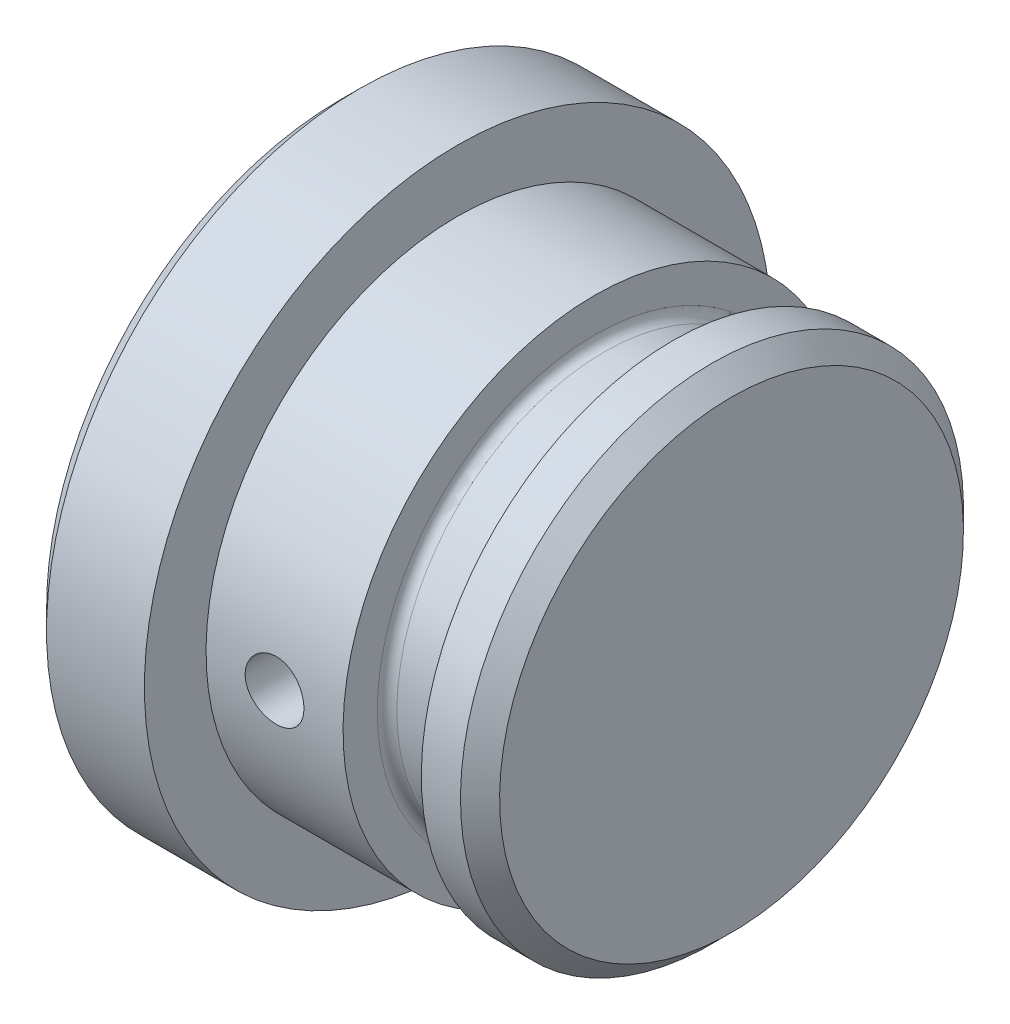
ISO-10303-21;
HEADER;
FILE_DESCRIPTION(('STEP AP214'),'2;1');
FILE_NAME('part.step','',(''),(''),'','','');
FILE_SCHEMA(('AUTOMOTIVE_DESIGN { 1 0 10303 214 1 1 1 1 }'));
ENDSEC;
DATA;
#1=APPLICATION_CONTEXT('core data for automotive mechanical design processes');
#2=APPLICATION_PROTOCOL_DEFINITION('international standard','automotive_design',2000,#1);
#3=PRODUCT_CONTEXT('',#1,'mechanical');
#4=PRODUCT('Part','Part','',(#3));
#5=PRODUCT_RELATED_PRODUCT_CATEGORY('part','',(#4));
#6=PRODUCT_DEFINITION_FORMATION('','',#4);
#7=PRODUCT_DEFINITION_CONTEXT('part definition',#1,'design');
#8=PRODUCT_DEFINITION('design','',#6,#7);
#9=PRODUCT_DEFINITION_SHAPE('','',#8);
#10=(LENGTH_UNIT() NAMED_UNIT(*) SI_UNIT(.MILLI.,.METRE.));
#11=(NAMED_UNIT(*) PLANE_ANGLE_UNIT() SI_UNIT($,.RADIAN.));
#12=(NAMED_UNIT(*) SI_UNIT($,.STERADIAN.) SOLID_ANGLE_UNIT());
#13=UNCERTAINTY_MEASURE_WITH_UNIT(LENGTH_MEASURE(1.E-05),#10,'distance_accuracy_value','');
#14=(GEOMETRIC_REPRESENTATION_CONTEXT(3) GLOBAL_UNCERTAINTY_ASSIGNED_CONTEXT((#13)) GLOBAL_UNIT_ASSIGNED_CONTEXT((#10,
#11,#12)) REPRESENTATION_CONTEXT('',''));
#15=CARTESIAN_POINT('',(0.,0.,0.));
#16=DIRECTION('',(0.,0.,1.));
#17=DIRECTION('',(1.,0.,0.));
#18=AXIS2_PLACEMENT_3D('',#15,#16,#17);
#19=CARTESIAN_POINT('',(-170.,19.5,0.));
#20=DIRECTION('',(1.,0.,0.));
#21=DIRECTION('',(0.,1.,0.));
#22=AXIS2_PLACEMENT_3D('',#19,#20,#21);
#23=PLANE('',#22);
#24=CARTESIAN_POINT('',(-170.,3.5,0.));
#25=DIRECTION('',(1.,0.,0.));
#26=DIRECTION('',(0.,1.,0.));
#27=AXIS2_PLACEMENT_3D('',#24,#25,#26);
#28=CIRCLE('',#27,16.);
#29=CARTESIAN_POINT('',(-170.,19.5,0.));
#30=VERTEX_POINT('',#29);
#31=EDGE_CURVE('E116',#30,#30,#28,.T.);
#32=ORIENTED_EDGE('',*,*,#31,.T.);
#33=EDGE_LOOP('',(#32));
#34=FACE_BOUND('',#33,.T.);
#35=CARTESIAN_POINT('',(-170.,3.5,0.));
#36=DIRECTION('',(1.,0.,0.));
#37=DIRECTION('',(0.,1.,0.));
#38=AXIS2_PLACEMENT_3D('',#35,#36,#37);
#39=CIRCLE('',#38,12.85);
#40=CARTESIAN_POINT('',(-170.,16.35,0.));
#41=VERTEX_POINT('',#40);
#42=EDGE_CURVE('E10',#41,#41,#39,.T.);
#43=ORIENTED_EDGE('',*,*,#42,.F.);
#44=EDGE_LOOP('',(#43));
#45=FACE_BOUND('',#44,.T.);
#46=ADVANCED_FACE('F31',(#34,#45),#23,.T.);
#47=CARTESIAN_POINT('',(-170.,3.5,0.));
#48=DIRECTION('',(1.,0.,0.));
#49=DIRECTION('',(0.,1.,0.));
#50=AXIS2_PLACEMENT_3D('',#47,#48,#49);
#51=CYLINDRICAL_SURFACE('',#50,12.85);
#52=CARTESIAN_POINT('',(-165.,3.5,-12.85));
#53=CARTESIAN_POINT('',(-165.000003592611,3.41605067776312,-12.8499988936772));
#54=CARTESIAN_POINT('',(-165.007071238831,3.33204781364189,-12.8491686286663));
#55=CARTESIAN_POINT('',(-165.035155630852,3.16637653613321,-12.845936389761));
#56=CARTESIAN_POINT('',(-165.056187227106,3.08471070469686,-12.8435327426367));
#57=CARTESIAN_POINT('',(-165.111574073372,2.92613614477345,-12.8374247170388));
#58=CARTESIAN_POINT('',(-165.145920680638,2.84922436791012,-12.8337211824667));
#59=CARTESIAN_POINT('',(-165.2269443965,2.70227223314071,-12.8254260734452));
#60=CARTESIAN_POINT('',(-165.273619270956,2.63223063336507,-12.8208346599386));
#61=CARTESIAN_POINT('',(-165.37821589032,2.50065340427525,-12.8112522259731));
#62=CARTESIAN_POINT('',(-165.43618520839,2.43915570839241,-12.8062595696213));
#63=CARTESIAN_POINT('',(-165.561623206124,2.326738462635,-12.7964506609921));
#64=CARTESIAN_POINT('',(-165.62909235318,2.27581943353672,-12.7916344174088));
#65=CARTESIAN_POINT('',(-165.771858412731,2.18586584904296,-12.7827073817069));
#66=CARTESIAN_POINT('',(-165.847177613199,2.14686644057015,-12.7785986911801));
#67=CARTESIAN_POINT('',(-166.003352064339,2.08208358192688,-12.7715731679468));
#68=CARTESIAN_POINT('',(-166.084207131175,2.05629969312968,-12.7686562956841));
#69=CARTESIAN_POINT('',(-166.248766500146,2.01879415913782,-12.764360055704));
#70=CARTESIAN_POINT('',(-166.332456097873,2.00700880819782,-12.7629737247182));
#71=CARTESIAN_POINT('',(-166.500635930697,1.99763783550078,-12.76187413547));
#72=CARTESIAN_POINT('',(-166.585126137467,2.00005171320306,-12.7621608182317));
#73=CARTESIAN_POINT('',(-166.752066570611,2.01895830901963,-12.7643684950189));
#74=CARTESIAN_POINT('',(-166.834524842087,2.03538107339416,-12.7662813684586));
#75=CARTESIAN_POINT('',(-166.995506912205,2.08173022135194,-12.7715132255116));
#76=CARTESIAN_POINT('',(-167.074030640466,2.11165684639845,-12.7748322342679));
#77=CARTESIAN_POINT('',(-167.225133244347,2.18424011515756,-12.7825116561436));
#78=CARTESIAN_POINT('',(-167.297697277006,2.22692738338883,-12.7868745694648));
#79=CARTESIAN_POINT('',(-167.434658096539,2.32379826288997,-12.7961482219364));
#80=CARTESIAN_POINT('',(-167.499054557325,2.37798233293632,-12.8010589829447));
#81=CARTESIAN_POINT('',(-167.618258454836,2.49669748899952,-12.8109111514929));
#82=CARTESIAN_POINT('',(-167.673005817758,2.56128891361156,-12.8158525655182));
#83=CARTESIAN_POINT('',(-167.770890454014,2.6987768885463,-12.825181520302));
#84=CARTESIAN_POINT('',(-167.814027706073,2.77167345408833,-12.8295690600455));
#85=CARTESIAN_POINT('',(-167.887466783449,2.92374710279487,-12.8372981518539));
#86=CARTESIAN_POINT('',(-167.917765100767,3.00292589545367,-12.8406394179791));
#87=CARTESIAN_POINT('',(-167.964619865243,3.16529474210934,-12.8458968042056));
#88=CARTESIAN_POINT('',(-167.981176873028,3.24848463231228,-12.8478129824481));
#89=CARTESIAN_POINT('',(-168.000001751609,3.41599450561187,-12.8499967686869));
#90=CARTESIAN_POINT('',(-168.002352427246,3.50030506350645,-12.8502739298632));
#91=CARTESIAN_POINT('',(-167.99291606904,3.66811891093716,-12.8491741841499));
#92=CARTESIAN_POINT('',(-167.981129296981,3.75162221539244,-12.8477973078883));
#93=CARTESIAN_POINT('',(-167.943821385859,3.91520876586093,-12.8435501941812));
#94=CARTESIAN_POINT('',(-167.918339477228,3.99530107902479,-12.8406842231012));
#95=CARTESIAN_POINT('',(-167.854405249618,4.15007513854755,-12.8337800034804));
#96=CARTESIAN_POINT('',(-167.815952542185,4.22475672278218,-12.8297417198312));
#97=CARTESIAN_POINT('',(-167.726966129402,4.36696083171018,-12.8209197803136));
#98=CARTESIAN_POINT('',(-167.676378561576,4.43444944365618,-12.816132835331));
#99=CARTESIAN_POINT('',(-167.564634986449,4.5600074442206,-12.8063600513226));
#100=CARTESIAN_POINT('',(-167.503478615009,4.61807650816443,-12.8013742054485));
#101=CARTESIAN_POINT('',(-167.371969888214,4.72343861670798,-12.7917363336831));
#102=CARTESIAN_POINT('',(-167.301573560199,4.77067696188423,-12.7870860801822));
#103=CARTESIAN_POINT('',(-167.153797826355,4.85265948760429,-12.7786743403585));
#104=CARTESIAN_POINT('',(-167.07641854519,4.88740389113972,-12.7749128381737));
#105=CARTESIAN_POINT('',(-166.91705383964,4.94332263407302,-12.7687162563322));
#106=CARTESIAN_POINT('',(-166.835079572806,4.9645284170062,-12.766278105174));
#107=CARTESIAN_POINT('',(-166.668703616573,4.99286950991363,-12.7629952396723));
#108=CARTESIAN_POINT('',(-166.584302024704,5.00000538441239,-12.7621504613983));
#109=CARTESIAN_POINT('',(-166.416011242853,4.9999946416936,-12.7621516808745));
#110=CARTESIAN_POINT('',(-166.33212203425,4.99293395146097,-12.7629875065009));
#111=CARTESIAN_POINT('',(-166.16673094779,4.96491182991293,-12.7662339533308));
#112=CARTESIAN_POINT('',(-166.085229071149,4.94395039151614,-12.7686445753364));
#113=CARTESIAN_POINT('',(-165.926933769389,4.88874757096884,-12.7747659693895));
#114=CARTESIAN_POINT('',(-165.85013908236,4.85450976615555,-12.778476391178));
#115=CARTESIAN_POINT('',(-165.70337157854,4.77373462732786,-12.7867799427332));
#116=CARTESIAN_POINT('',(-165.633398803752,4.72719721759064,-12.7913730779343));
#117=CARTESIAN_POINT('',(-165.501821592046,4.62282347730375,-12.8009578580409));
#118=CARTESIAN_POINT('',(-165.440268147937,4.56492305834083,-12.8059516636458));
#119=CARTESIAN_POINT('',(-165.327716757235,4.43959898354941,-12.8157557614984));
#120=CARTESIAN_POINT('',(-165.276721315845,4.37217307388366,-12.8205660099712));
#121=CARTESIAN_POINT('',(-165.186591849787,4.22945734533819,-12.8294784350379));
#122=CARTESIAN_POINT('',(-165.147497952789,4.15414204862991,-12.8335781965499));
#123=CARTESIAN_POINT('',(-165.082566823106,3.99801196870743,-12.8405827669036));
#124=CARTESIAN_POINT('',(-165.056714992397,3.91720335315886,-12.8434888909049));
#125=CARTESIAN_POINT('',(-165.025282156121,3.7799684781299,-12.847067594294));
#126=CARTESIAN_POINT('',(-165.015814731882,3.72441211251144,-12.8481619712938));
#127=CARTESIAN_POINT('',(-165.003172468414,3.61257852237914,-12.8496285429141));
#128=CARTESIAN_POINT('',(-164.999997590586,3.55630130228916,-12.8500007419645));
#129=CARTESIAN_POINT('',(-165.,3.5,-12.85));
#130=B_SPLINE_CURVE_WITH_KNOTS('',3,(#52,#53,#54,#55,#56,#57,#58,#59,#60,#61,#62,#63,#64,#65,
#66,#67,#68,#69,#70,#71,#72,#73,#74,#75,#76,#77,#78,#79,#80,#81,#82,#83,#84,#85,#86,#87,#88,#89,
#90,#91,#92,#93,#94,#95,#96,#97,#98,#99,#100,#101,#102,#103,#104,#105,#106,#107,#108,#109,#110,
#111,#112,#113,#114,#115,#116,#117,#118,#119,#120,#121,#122,#123,#124,#125,#126,#127,#128,#129),
.UNSPECIFIED.,.T.,.F.,(4,2,2,2,2,2,2,2,2,2,2,2,2,2,2,2,2,2,2,2,2,2,2,2,2,2,2,2,2,2,2,2,2,2,2,2,
2,2,4),(0.,0.251642337484341,0.503552722407622,0.755299865861738,1.00700141871519,
1.25978702052099,1.51258506374088,1.76612148691324,2.01964949459652,2.27201924993303,
2.52438010897159,2.77548812532648,3.02660063193522,3.27832069384813,3.53005080246546,
3.78329666938567,4.03654300039167,4.28985848168219,4.54316362753341,4.79499089157282,
5.04681349256707,5.29791854971487,5.54903112773556,5.80127963283145,6.05353683062499,
6.30704126343116,6.56054117147087,6.8134501617409,7.06634900438071,7.31772174422334,
7.56909461212124,7.82039979422896,8.07170652353929,8.32447363939172,8.57730066324158,
8.83097092037256,9.08436092688465,9.25312796204677,9.42189396198518),.UNSPECIFIED.);
#131=CARTESIAN_POINT('',(-165.,3.5,-12.85));
#132=VERTEX_POINT('',#131);
#133=EDGE_CURVE('E34',#132,#132,#130,.T.);
#134=ORIENTED_EDGE('',*,*,#133,.F.);
#135=EDGE_LOOP('',(#134));
#136=FACE_BOUND('',#135,.T.);
#137=CARTESIAN_POINT('',(-165.,3.5,12.85));
#138=CARTESIAN_POINT('',(-165.000003592611,3.58394932223687,12.8499988936772));
#139=CARTESIAN_POINT('',(-165.007071238831,3.66795218635811,12.8491686286663));
#140=CARTESIAN_POINT('',(-165.035155630852,3.83362346386679,12.845936389761));
#141=CARTESIAN_POINT('',(-165.056187227106,3.91528929530313,12.8435327426367));
#142=CARTESIAN_POINT('',(-165.111574073372,4.07386385522655,12.8374247170388));
#143=CARTESIAN_POINT('',(-165.145920680638,4.15077563208987,12.8337211824667));
#144=CARTESIAN_POINT('',(-165.2269443965,4.29772776685929,12.8254260734452));
#145=CARTESIAN_POINT('',(-165.273619270956,4.36776936663493,12.8208346599386));
#146=CARTESIAN_POINT('',(-165.37821589032,4.49934659572475,12.8112522259731));
#147=CARTESIAN_POINT('',(-165.43618520839,4.56084429160758,12.8062595696213));
#148=CARTESIAN_POINT('',(-165.561623206124,4.673261537365,12.7964506609921));
#149=CARTESIAN_POINT('',(-165.62909235318,4.72418056646328,12.7916344174088));
#150=CARTESIAN_POINT('',(-165.771858412731,4.81413415095703,12.7827073817069));
#151=CARTESIAN_POINT('',(-165.847177613199,4.85313355942984,12.7785986911801));
#152=CARTESIAN_POINT('',(-166.003352064339,4.91791641807311,12.7715731679468));
#153=CARTESIAN_POINT('',(-166.084207131174,4.94370030687032,12.7686562956841));
#154=CARTESIAN_POINT('',(-166.248766500146,4.98120584086218,12.764360055704));
#155=CARTESIAN_POINT('',(-166.332456097873,4.99299119180217,12.7629737247182));
#156=CARTESIAN_POINT('',(-166.500635930697,5.00236216449922,12.76187413547));
#157=CARTESIAN_POINT('',(-166.585126137467,4.99994828679694,12.7621608182317));
#158=CARTESIAN_POINT('',(-166.752066570611,4.98104169098037,12.7643684950189));
#159=CARTESIAN_POINT('',(-166.834524842087,4.96461892660584,12.7662813684586));
#160=CARTESIAN_POINT('',(-166.995506912205,4.91826977864805,12.7715132255116));
#161=CARTESIAN_POINT('',(-167.074030640466,4.88834315360154,12.7748322342679));
#162=CARTESIAN_POINT('',(-167.225133244347,4.81575988484243,12.7825116561436));
#163=CARTESIAN_POINT('',(-167.297697277006,4.77307261661117,12.7868745694648));
#164=CARTESIAN_POINT('',(-167.434658096539,4.67620173711003,12.7961482219364));
#165=CARTESIAN_POINT('',(-167.499054557325,4.62201766706368,12.8010589829447));
#166=CARTESIAN_POINT('',(-167.618258454836,4.50330251100048,12.8109111514929));
#167=CARTESIAN_POINT('',(-167.673005817758,4.43871108638843,12.8158525655182));
#168=CARTESIAN_POINT('',(-167.770890454014,4.3012231114537,12.825181520302));
#169=CARTESIAN_POINT('',(-167.814027706073,4.22832654591167,12.8295690600455));
#170=CARTESIAN_POINT('',(-167.887466783449,4.07625289720513,12.8372981518539));
#171=CARTESIAN_POINT('',(-167.917765100767,3.99707410454633,12.8406394179791));
#172=CARTESIAN_POINT('',(-167.964619865243,3.83470525789066,12.8458968042056));
#173=CARTESIAN_POINT('',(-167.981176873028,3.75151536768772,12.8478129824481));
#174=CARTESIAN_POINT('',(-168.000001751609,3.58400549438813,12.8499967686869));
#175=CARTESIAN_POINT('',(-168.002352427246,3.49969493649355,12.8502739298632));
#176=CARTESIAN_POINT('',(-167.99291606904,3.33188108906284,12.8491741841499));
#177=CARTESIAN_POINT('',(-167.981129296981,3.24837778460755,12.8477973078883));
#178=CARTESIAN_POINT('',(-167.943821385859,3.08479123413906,12.8435501941812));
#179=CARTESIAN_POINT('',(-167.918339477228,3.00469892097521,12.8406842231012));
#180=CARTESIAN_POINT('',(-167.854405249618,2.84992486145245,12.8337800034804));
#181=CARTESIAN_POINT('',(-167.815952542185,2.77524327721782,12.8297417198312));
#182=CARTESIAN_POINT('',(-167.726966129402,2.63303916828982,12.8209197803136));
#183=CARTESIAN_POINT('',(-167.676378561576,2.56555055634382,12.816132835331));
#184=CARTESIAN_POINT('',(-167.564634986449,2.4399925557794,12.8063600513226));
#185=CARTESIAN_POINT('',(-167.503478615009,2.38192349183557,12.8013742054485));
#186=CARTESIAN_POINT('',(-167.371969888214,2.27656138329203,12.7917363336831));
#187=CARTESIAN_POINT('',(-167.301573560199,2.22932303811579,12.7870860801822));
#188=CARTESIAN_POINT('',(-167.153797826355,2.14734051239572,12.7786743403585));
#189=CARTESIAN_POINT('',(-167.07641854519,2.11259610886028,12.7749128381737));
#190=CARTESIAN_POINT('',(-166.91705383964,2.05667736592697,12.7687162563322));
#191=CARTESIAN_POINT('',(-166.835079572806,2.03547158299379,12.766278105174));
#192=CARTESIAN_POINT('',(-166.668703616573,2.00713049008636,12.7629952396723));
#193=CARTESIAN_POINT('',(-166.584302024704,1.99999461558761,12.7621504613983));
#194=CARTESIAN_POINT('',(-166.416011242853,2.0000053583064,12.7621516808745));
#195=CARTESIAN_POINT('',(-166.33212203425,2.00706604853902,12.7629875065009));
#196=CARTESIAN_POINT('',(-166.16673094779,2.03508817008707,12.7662339533308));
#197=CARTESIAN_POINT('',(-166.085229071149,2.05604960848385,12.7686445753364));
#198=CARTESIAN_POINT('',(-165.926933769389,2.11125242903115,12.7747659693895));
#199=CARTESIAN_POINT('',(-165.85013908236,2.14549023384444,12.778476391178));
#200=CARTESIAN_POINT('',(-165.70337157854,2.22626537267213,12.7867799427332));
#201=CARTESIAN_POINT('',(-165.633398803752,2.27280278240936,12.7913730779343));
#202=CARTESIAN_POINT('',(-165.501821592046,2.37717652269625,12.8009578580409));
#203=CARTESIAN_POINT('',(-165.440268147937,2.43507694165916,12.8059516636458));
#204=CARTESIAN_POINT('',(-165.327716757235,2.56040101645059,12.8157557614984));
#205=CARTESIAN_POINT('',(-165.276721315845,2.62782692611634,12.8205660099712));
#206=CARTESIAN_POINT('',(-165.186591849787,2.7705426546618,12.8294784350379));
#207=CARTESIAN_POINT('',(-165.147497952789,2.84585795137008,12.8335781965499));
#208=CARTESIAN_POINT('',(-165.082566823106,3.00198803129256,12.8405827669036));
#209=CARTESIAN_POINT('',(-165.056714992397,3.08279664684113,12.8434888909049));
#210=CARTESIAN_POINT('',(-165.025282156121,3.2200315218701,12.847067594294));
#211=CARTESIAN_POINT('',(-165.015814731882,3.27558788748856,12.8481619712938));
#212=CARTESIAN_POINT('',(-165.003172468414,3.38742147762086,12.8496285429141));
#213=CARTESIAN_POINT('',(-164.999997590586,3.44369869771083,12.8500007419645));
#214=CARTESIAN_POINT('',(-165.,3.5,12.85));
#215=B_SPLINE_CURVE_WITH_KNOTS('',3,(#137,#138,#139,#140,#141,#142,#143,#144,#145,#146,#147,
#148,#149,#150,#151,#152,#153,#154,#155,#156,#157,#158,#159,#160,#161,#162,#163,#164,#165,#166,
#167,#168,#169,#170,#171,#172,#173,#174,#175,#176,#177,#178,#179,#180,#181,#182,#183,#184,#185,
#186,#187,#188,#189,#190,#191,#192,#193,#194,#195,#196,#197,#198,#199,#200,#201,#202,#203,#204,
#205,#206,#207,#208,#209,#210,#211,#212,#213,#214),.UNSPECIFIED.,.T.,.F.,(4,2,2,2,2,2,2,2,2,2,2,
2,2,2,2,2,2,2,2,2,2,2,2,2,2,2,2,2,2,2,2,2,2,2,2,2,2,2,4),(0.,0.25164233748434,0.503552722407621,
0.755299865861738,1.00700141871519,1.25978702052099,1.51258506374088,1.76612148691321,
2.01964949459652,2.27201924993303,2.52438010897159,2.77548812532648,3.02660063193522,
3.27832069384813,3.53005080246546,3.78329666938567,4.03654300039168,4.28985848168218,
4.54316362753341,4.79499089157282,5.04681349256707,5.29791854971487,5.54903112773556,
5.80127963283145,6.05353683062499,6.30704126343113,6.56054117147087,6.81345016174093,
7.06634900438071,7.31772174422334,7.56909461212124,7.82039979422896,8.07170652353929,
8.32447363939172,8.57730066324158,8.83097092037255,9.08436092688465,9.25312796204677,
9.42189396198518),.UNSPECIFIED.);
#216=CARTESIAN_POINT('',(-165.,3.5,12.85));
#217=VERTEX_POINT('',#216);
#218=EDGE_CURVE('E49',#217,#217,#215,.T.);
#219=ORIENTED_EDGE('',*,*,#218,.F.);
#220=EDGE_LOOP('',(#219));
#221=FACE_BOUND('',#220,.T.);
#222=ORIENTED_EDGE('',*,*,#42,.T.);
#223=EDGE_LOOP('',(#222));
#224=FACE_BOUND('',#223,.T.);
#225=CARTESIAN_POINT('',(-163.,3.5,0.));
#226=DIRECTION('',(1.,0.,0.));
#227=DIRECTION('',(0.,1.,0.));
#228=AXIS2_PLACEMENT_3D('',#225,#226,#227);
#229=CIRCLE('',#228,12.85);
#230=CARTESIAN_POINT('',(-163.,16.35,0.));
#231=VERTEX_POINT('',#230);
#232=EDGE_CURVE('E41',#231,#231,#229,.T.);
#233=ORIENTED_EDGE('',*,*,#232,.F.);
#234=EDGE_LOOP('',(#233));
#235=FACE_BOUND('',#234,.T.);
#236=ADVANCED_FACE('F53',(#136,#221,#224,#235),#51,.T.);
#237=CARTESIAN_POINT('',(-163.,16.35,0.));
#238=DIRECTION('',(1.,0.,0.));
#239=DIRECTION('',(0.,1.,0.));
#240=AXIS2_PLACEMENT_3D('',#237,#238,#239);
#241=PLANE('',#240);
#242=ORIENTED_EDGE('',*,*,#232,.T.);
#243=EDGE_LOOP('',(#242));
#244=FACE_BOUND('',#243,.T.);
#245=CARTESIAN_POINT('',(-163.,3.5,0.));
#246=DIRECTION('',(1.,0.,0.));
#247=DIRECTION('',(0.,1.,0.));
#248=AXIS2_PLACEMENT_3D('',#245,#246,#247);
#249=CIRCLE('',#248,11.1);
#250=CARTESIAN_POINT('',(-163.,14.6,0.));
#251=VERTEX_POINT('',#250);
#252=EDGE_CURVE('E46',#251,#251,#249,.T.);
#253=ORIENTED_EDGE('',*,*,#252,.F.);
#254=EDGE_LOOP('',(#253));
#255=FACE_BOUND('',#254,.T.);
#256=ADVANCED_FACE('F100',(#244,#255),#241,.T.);
#257=CARTESIAN_POINT('',(-162.5,3.5,0.));
#258=DIRECTION('',(1.,0.,0.));
#259=DIRECTION('',(0.,1.,0.));
#260=AXIS2_PLACEMENT_3D('',#257,#258,#259);
#261=TOROIDAL_SURFACE('',#260,11.1,0.5);
#262=ORIENTED_EDGE('',*,*,#252,.T.);
#263=EDGE_LOOP('',(#262));
#264=FACE_BOUND('',#263,.T.);
#265=CARTESIAN_POINT('',(-162.5,3.5,0.));
#266=DIRECTION('',(1.,0.,0.));
#267=DIRECTION('',(0.,1.,0.));
#268=AXIS2_PLACEMENT_3D('',#265,#266,#267);
#269=CIRCLE('',#268,10.6);
#270=CARTESIAN_POINT('',(-162.5,14.1,0.));
#271=VERTEX_POINT('',#270);
#272=EDGE_CURVE('E142',#271,#271,#269,.T.);
#273=ORIENTED_EDGE('',*,*,#272,.F.);
#274=EDGE_LOOP('',(#273));
#275=FACE_BOUND('',#274,.T.);
#276=ADVANCED_FACE('F97',(#264,#275),#261,.F.);
#277=CARTESIAN_POINT('',(-170.,3.5,0.));
#278=DIRECTION('',(1.,0.,0.));
#279=DIRECTION('',(0.,1.,0.));
#280=AXIS2_PLACEMENT_3D('',#277,#278,#279);
#281=CYLINDRICAL_SURFACE('',#280,10.6);
#282=ORIENTED_EDGE('',*,*,#272,.T.);
#283=EDGE_LOOP('',(#282));
#284=FACE_BOUND('',#283,.T.);
#285=CARTESIAN_POINT('',(-159.5,3.5,0.));
#286=DIRECTION('',(1.,0.,0.));
#287=DIRECTION('',(0.,1.,0.));
#288=AXIS2_PLACEMENT_3D('',#285,#286,#287);
#289=CIRCLE('',#288,10.6);
#290=CARTESIAN_POINT('',(-159.5,14.1,0.));
#291=VERTEX_POINT('',#290);
#292=EDGE_CURVE('E139',#291,#291,#289,.T.);
#293=ORIENTED_EDGE('',*,*,#292,.F.);
#294=EDGE_LOOP('',(#293));
#295=FACE_BOUND('',#294,.T.);
#296=ADVANCED_FACE('F93',(#284,#295),#281,.T.);
#297=CARTESIAN_POINT('',(-159.5,3.5,0.));
#298=DIRECTION('',(1.,0.,0.));
#299=DIRECTION('',(0.,1.,0.));
#300=AXIS2_PLACEMENT_3D('',#297,#298,#299);
#301=TOROIDAL_SURFACE('',#300,11.1,0.5);
#302=ORIENTED_EDGE('',*,*,#292,.T.);
#303=EDGE_LOOP('',(#302));
#304=FACE_BOUND('',#303,.T.);
#305=CARTESIAN_POINT('',(-159.,3.5,0.));
#306=DIRECTION('',(1.,0.,0.));
#307=DIRECTION('',(0.,1.,0.));
#308=AXIS2_PLACEMENT_3D('',#305,#306,#307);
#309=CIRCLE('',#308,11.1);
#310=CARTESIAN_POINT('',(-159.,14.6,0.));
#311=VERTEX_POINT('',#310);
#312=EDGE_CURVE('E136',#311,#311,#309,.T.);
#313=ORIENTED_EDGE('',*,*,#312,.F.);
#314=EDGE_LOOP('',(#313));
#315=FACE_BOUND('',#314,.T.);
#316=ADVANCED_FACE('F89',(#304,#315),#301,.F.);
#317=CARTESIAN_POINT('',(-159.,14.6,0.));
#318=DIRECTION('',(-1.,0.,0.));
#319=DIRECTION('',(0.,-1.,0.));
#320=AXIS2_PLACEMENT_3D('',#317,#318,#319);
#321=PLANE('',#320);
#322=ORIENTED_EDGE('',*,*,#312,.T.);
#323=EDGE_LOOP('',(#322));
#324=FACE_BOUND('',#323,.T.);
#325=CARTESIAN_POINT('',(-159.,3.5,0.));
#326=DIRECTION('',(1.,0.,0.));
#327=DIRECTION('',(0.,1.,0.));
#328=AXIS2_PLACEMENT_3D('',#325,#326,#327);
#329=CIRCLE('',#328,12.85);
#330=CARTESIAN_POINT('',(-159.,16.35,0.));
#331=VERTEX_POINT('',#330);
#332=EDGE_CURVE('E133',#331,#331,#329,.T.);
#333=ORIENTED_EDGE('',*,*,#332,.F.);
#334=EDGE_LOOP('',(#333));
#335=FACE_BOUND('',#334,.T.);
#336=ADVANCED_FACE('F85',(#324,#335),#321,.T.);
#337=CARTESIAN_POINT('',(-170.,3.5,0.));
#338=DIRECTION('',(1.,0.,0.));
#339=DIRECTION('',(0.,1.,0.));
#340=AXIS2_PLACEMENT_3D('',#337,#338,#339);
#341=CYLINDRICAL_SURFACE('',#340,12.85);
#342=ORIENTED_EDGE('',*,*,#332,.T.);
#343=EDGE_LOOP('',(#342));
#344=FACE_BOUND('',#343,.T.);
#345=CARTESIAN_POINT('',(-157.,3.5,0.));
#346=DIRECTION('',(1.,0.,0.));
#347=DIRECTION('',(0.,1.,0.));
#348=AXIS2_PLACEMENT_3D('',#345,#346,#347);
#349=CIRCLE('',#348,12.85);
#350=CARTESIAN_POINT('',(-157.,16.35,0.));
#351=VERTEX_POINT('',#350);
#352=EDGE_CURVE('E130',#351,#351,#349,.T.);
#353=ORIENTED_EDGE('',*,*,#352,.F.);
#354=EDGE_LOOP('',(#353));
#355=FACE_BOUND('',#354,.T.);
#356=ADVANCED_FACE('F81',(#344,#355),#341,.T.);
#357=CARTESIAN_POINT('',(-156.,3.5,0.));
#358=DIRECTION('',(-1.,0.,0.));
#359=DIRECTION('',(0.,-1.,0.));
#360=AXIS2_PLACEMENT_3D('',#357,#358,#359);
#361=CONICAL_SURFACE('',#360,11.85,0.785398163397448);
#362=ORIENTED_EDGE('',*,*,#352,.T.);
#363=EDGE_LOOP('',(#362));
#364=FACE_BOUND('',#363,.T.);
#365=CARTESIAN_POINT('',(-156.,3.5,0.));
#366=DIRECTION('',(1.,0.,0.));
#367=DIRECTION('',(0.,1.,0.));
#368=AXIS2_PLACEMENT_3D('',#365,#366,#367);
#369=CIRCLE('',#368,11.85);
#370=CARTESIAN_POINT('',(-156.,15.35,0.));
#371=VERTEX_POINT('',#370);
#372=EDGE_CURVE('E127',#371,#371,#369,.T.);
#373=ORIENTED_EDGE('',*,*,#372,.F.);
#374=EDGE_LOOP('',(#373));
#375=FACE_BOUND('',#374,.T.);
#376=ADVANCED_FACE('F77',(#364,#375),#361,.T.);
#377=CARTESIAN_POINT('',(-156.,15.35,0.));
#378=DIRECTION('',(1.,0.,0.));
#379=DIRECTION('',(0.,1.,0.));
#380=AXIS2_PLACEMENT_3D('',#377,#378,#379);
#381=PLANE('',#380);
#382=ORIENTED_EDGE('',*,*,#372,.T.);
#383=EDGE_LOOP('',(#382));
#384=FACE_BOUND('',#383,.T.);
#385=ADVANCED_FACE('F73',(#384),#381,.T.);
#386=CARTESIAN_POINT('',(-176.,18.5,0.));
#387=DIRECTION('',(-1.,0.,0.));
#388=DIRECTION('',(0.,-1.,0.));
#389=AXIS2_PLACEMENT_3D('',#386,#387,#388);
#390=PLANE('',#389);
#391=CARTESIAN_POINT('',(-176.,3.5,0.));
#392=DIRECTION('',(1.,0.,0.));
#393=DIRECTION('',(0.,1.,0.));
#394=AXIS2_PLACEMENT_3D('',#391,#392,#393);
#395=CIRCLE('',#394,15.);
#396=CARTESIAN_POINT('',(-176.,18.5,0.));
#397=VERTEX_POINT('',#396);
#398=EDGE_CURVE('E121',#397,#397,#395,.T.);
#399=ORIENTED_EDGE('',*,*,#398,.F.);
#400=EDGE_LOOP('',(#399));
#401=FACE_BOUND('',#400,.T.);
#402=ADVANCED_FACE('F69',(#401),#390,.T.);
#403=CARTESIAN_POINT('',(-175.,3.5,0.));
#404=DIRECTION('',(1.,0.,0.));
#405=DIRECTION('',(0.,1.,0.));
#406=AXIS2_PLACEMENT_3D('',#403,#404,#405);
#407=CONICAL_SURFACE('',#406,16.,0.785398163397447);
#408=ORIENTED_EDGE('',*,*,#398,.T.);
#409=EDGE_LOOP('',(#408));
#410=FACE_BOUND('',#409,.T.);
#411=CARTESIAN_POINT('',(-175.,3.5,0.));
#412=DIRECTION('',(1.,0.,0.));
#413=DIRECTION('',(0.,1.,0.));
#414=AXIS2_PLACEMENT_3D('',#411,#412,#413);
#415=CIRCLE('',#414,16.);
#416=CARTESIAN_POINT('',(-175.,19.5,0.));
#417=VERTEX_POINT('',#416);
#418=EDGE_CURVE('E118',#417,#417,#415,.T.);
#419=ORIENTED_EDGE('',*,*,#418,.F.);
#420=EDGE_LOOP('',(#419));
#421=FACE_BOUND('',#420,.T.);
#422=ADVANCED_FACE('F65',(#410,#421),#407,.T.);
#423=CARTESIAN_POINT('',(-170.,3.5,0.));
#424=DIRECTION('',(1.,0.,0.));
#425=DIRECTION('',(0.,1.,0.));
#426=AXIS2_PLACEMENT_3D('',#423,#424,#425);
#427=CYLINDRICAL_SURFACE('',#426,16.);
#428=ORIENTED_EDGE('',*,*,#418,.T.);
#429=EDGE_LOOP('',(#428));
#430=FACE_BOUND('',#429,.T.);
#431=ORIENTED_EDGE('',*,*,#31,.F.);
#432=EDGE_LOOP('',(#431));
#433=FACE_BOUND('',#432,.T.);
#434=ADVANCED_FACE('F60',(#430,#433),#427,.T.);
#435=CARTESIAN_POINT('',(-166.5,3.5,-16.));
#436=DIRECTION('',(0.,0.,1.));
#437=DIRECTION('',(1.,0.,0.));
#438=AXIS2_PLACEMENT_3D('',#435,#436,#437);
#439=CYLINDRICAL_SURFACE('',#438,1.5);
#440=ORIENTED_EDGE('',*,*,#133,.T.);
#441=EDGE_LOOP('',(#440));
#442=FACE_BOUND('',#441,.T.);
#443=ORIENTED_EDGE('',*,*,#218,.T.);
#444=EDGE_LOOP('',(#443));
#445=FACE_BOUND('',#444,.T.);
#446=ADVANCED_FACE('F56',(#442,#445),#439,.F.);
#447=CLOSED_SHELL('',(#46,#236,#256,#276,#296,#316,#336,#356,#376,#385,#402,#422,#434,#446));
#448=MANIFOLD_SOLID_BREP('B2',#447);
#449=ADVANCED_BREP_SHAPE_REPRESENTATION('',(#18,#448),#14);
#450=SHAPE_DEFINITION_REPRESENTATION(#9,#449);
ENDSEC;
END-ISO-10303-21;
